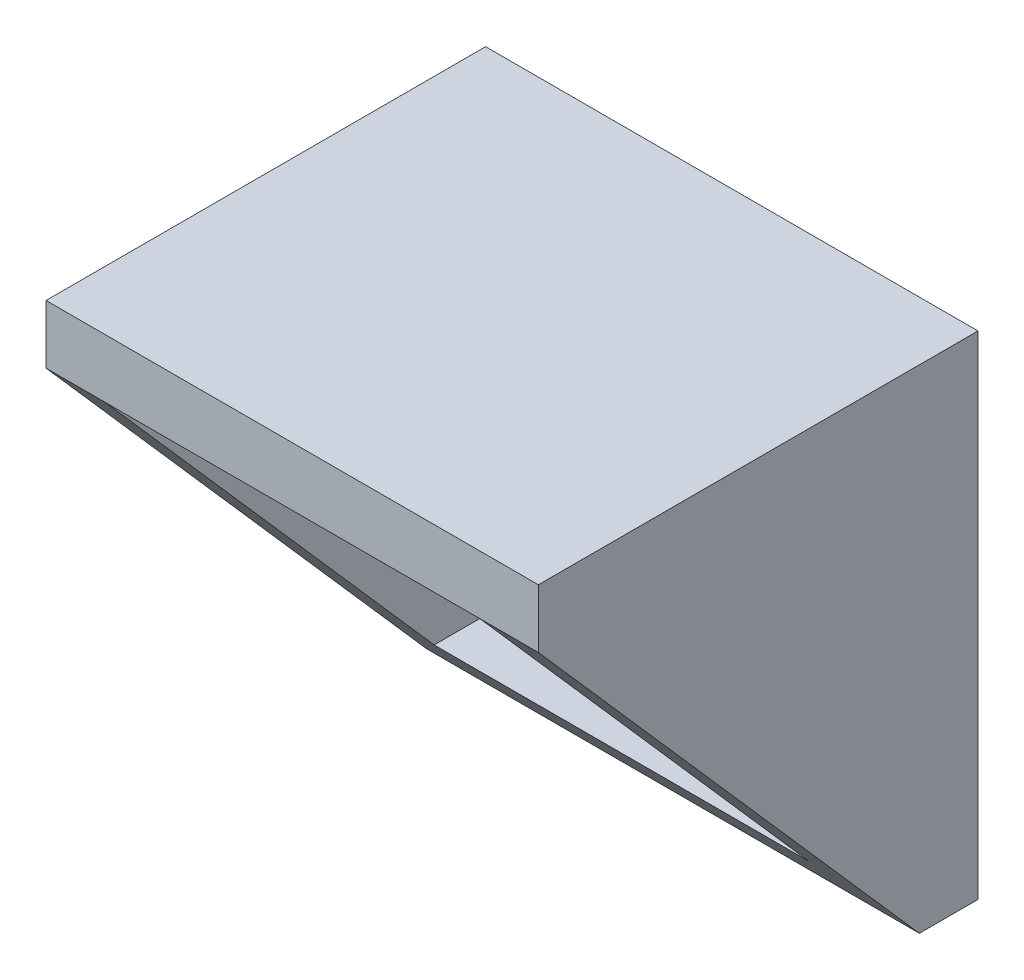
ISO-10303-21;
HEADER;
FILE_DESCRIPTION(('STEP AP214'),'2;1');
FILE_NAME('part.step','',(''),(''),'','','');
FILE_SCHEMA(('AUTOMOTIVE_DESIGN { 1 0 10303 214 1 1 1 1 }'));
ENDSEC;
DATA;
#1=APPLICATION_CONTEXT('core data for automotive mechanical design processes');
#2=APPLICATION_PROTOCOL_DEFINITION('international standard','automotive_design',2000,#1);
#3=PRODUCT_CONTEXT('',#1,'mechanical');
#4=PRODUCT('Part','Part','',(#3));
#5=PRODUCT_RELATED_PRODUCT_CATEGORY('part','',(#4));
#6=PRODUCT_DEFINITION_FORMATION('','',#4);
#7=PRODUCT_DEFINITION_CONTEXT('part definition',#1,'design');
#8=PRODUCT_DEFINITION('design','',#6,#7);
#9=PRODUCT_DEFINITION_SHAPE('','',#8);
#10=(LENGTH_UNIT() NAMED_UNIT(*) SI_UNIT(.MILLI.,.METRE.));
#11=(NAMED_UNIT(*) PLANE_ANGLE_UNIT() SI_UNIT($,.RADIAN.));
#12=(NAMED_UNIT(*) SI_UNIT($,.STERADIAN.) SOLID_ANGLE_UNIT());
#13=UNCERTAINTY_MEASURE_WITH_UNIT(LENGTH_MEASURE(1.E-05),#10,'distance_accuracy_value','');
#14=(GEOMETRIC_REPRESENTATION_CONTEXT(3) GLOBAL_UNCERTAINTY_ASSIGNED_CONTEXT((#13)) GLOBAL_UNIT_ASSIGNED_CONTEXT((#10,
#11,#12)) REPRESENTATION_CONTEXT('',''));
#15=CARTESIAN_POINT('',(0.,0.,0.));
#16=DIRECTION('',(0.,0.,1.));
#17=DIRECTION('',(1.,0.,0.));
#18=AXIS2_PLACEMENT_3D('',#15,#16,#17);
#19=CARTESIAN_POINT('',(0.,0.,15.));
#20=DIRECTION('',(0.,0.,1.));
#21=DIRECTION('',(1.,0.,0.));
#22=AXIS2_PLACEMENT_3D('',#19,#20,#21);
#23=PLANE('',#22);
#24=DIRECTION('',(1.,0.,0.));
#25=VECTOR('',#24,1.);
#26=CARTESIAN_POINT('',(-8.4,6.4,15.));
#27=LINE('',#26,#25);
#28=CARTESIAN_POINT('',(6.4,6.4,15.));
#29=VERTEX_POINT('',#28);
#30=CARTESIAN_POINT('',(8.4,6.4,15.));
#31=VERTEX_POINT('',#30);
#32=EDGE_CURVE('E48',#29,#31,#27,.T.);
#33=ORIENTED_EDGE('',*,*,#32,.T.);
#34=DIRECTION('',(0.,1.,0.));
#35=VECTOR('',#34,1.);
#36=CARTESIAN_POINT('',(8.4,8.4,15.));
#37=LINE('',#36,#35);
#38=CARTESIAN_POINT('',(8.4,8.4,15.));
#39=VERTEX_POINT('',#38);
#40=EDGE_CURVE('E157',#31,#39,#37,.T.);
#41=ORIENTED_EDGE('',*,*,#40,.T.);
#42=DIRECTION('',(-1.,0.,0.));
#43=VECTOR('',#42,1.);
#44=CARTESIAN_POINT('',(-8.4,8.4,15.));
#45=LINE('',#44,#43);
#46=CARTESIAN_POINT('',(-8.4,8.4,15.));
#47=VERTEX_POINT('',#46);
#48=EDGE_CURVE('E137',#39,#47,#45,.T.);
#49=ORIENTED_EDGE('',*,*,#48,.T.);
#50=DIRECTION('',(0.,-1.,0.));
#51=VECTOR('',#50,1.);
#52=CARTESIAN_POINT('',(-8.4,8.4,15.));
#53=LINE('',#52,#51);
#54=CARTESIAN_POINT('',(-8.4,6.4,15.));
#55=VERTEX_POINT('',#54);
#56=EDGE_CURVE('E143',#47,#55,#53,.T.);
#57=ORIENTED_EDGE('',*,*,#56,.T.);
#58=CARTESIAN_POINT('',(-6.4,6.4,15.));
#59=VERTEX_POINT('',#58);
#60=EDGE_CURVE('E108',#55,#59,#27,.T.);
#61=ORIENTED_EDGE('',*,*,#60,.T.);
#62=DIRECTION('',(-1.,0.,0.));
#63=VECTOR('',#62,1.);
#64=CARTESIAN_POINT('',(-6.4,6.4,15.));
#65=LINE('',#64,#63);
#66=EDGE_CURVE('E166',#29,#59,#65,.T.);
#67=ORIENTED_EDGE('',*,*,#66,.F.);
#68=EDGE_LOOP('',(#33,#41,#49,#57,#61,#67));
#69=FACE_BOUND('',#68,.T.);
#70=ADVANCED_FACE('F33',(#69),#23,.T.);
#71=CARTESIAN_POINT('',(0.,0.,0.));
#72=DIRECTION('',(0.,0.,1.));
#73=DIRECTION('',(1.,0.,0.));
#74=AXIS2_PLACEMENT_3D('',#71,#72,#73);
#75=PLANE('',#74);
#76=DIRECTION('',(0.,-1.,0.));
#77=VECTOR('',#76,1.);
#78=CARTESIAN_POINT('',(-8.4,8.4,0.));
#79=LINE('',#78,#77);
#80=CARTESIAN_POINT('',(-8.4,8.4,0.));
#81=VERTEX_POINT('',#80);
#82=CARTESIAN_POINT('',(-8.4,-8.4,0.));
#83=VERTEX_POINT('',#82);
#84=EDGE_CURVE('E124',#81,#83,#79,.T.);
#85=ORIENTED_EDGE('',*,*,#84,.F.);
#86=DIRECTION('',(-1.,0.,0.));
#87=VECTOR('',#86,1.);
#88=CARTESIAN_POINT('',(-8.4,8.4,0.));
#89=LINE('',#88,#87);
#90=CARTESIAN_POINT('',(8.4,8.4,0.));
#91=VERTEX_POINT('',#90);
#92=EDGE_CURVE('E141',#91,#81,#89,.T.);
#93=ORIENTED_EDGE('',*,*,#92,.F.);
#94=DIRECTION('',(0.,1.,0.));
#95=VECTOR('',#94,1.);
#96=CARTESIAN_POINT('',(8.4,8.4,0.));
#97=LINE('',#96,#95);
#98=CARTESIAN_POINT('',(8.40000000000001,-8.4,0.));
#99=VERTEX_POINT('',#98);
#100=EDGE_CURVE('E132',#99,#91,#97,.T.);
#101=ORIENTED_EDGE('',*,*,#100,.F.);
#102=DIRECTION('',(1.,0.,0.));
#103=VECTOR('',#102,1.);
#104=CARTESIAN_POINT('',(-8.4,-8.4,0.));
#105=LINE('',#104,#103);
#106=EDGE_CURVE('E129',#83,#99,#105,.T.);
#107=ORIENTED_EDGE('',*,*,#106,.F.);
#108=EDGE_LOOP('',(#85,#93,#101,#107));
#109=FACE_BOUND('',#108,.T.);
#110=DIRECTION('',(0.,-1.,0.));
#111=VECTOR('',#110,1.);
#112=CARTESIAN_POINT('',(-6.4,6.4,0.));
#113=LINE('',#112,#111);
#114=CARTESIAN_POINT('',(-6.4,6.4,0.));
#115=VERTEX_POINT('',#114);
#116=CARTESIAN_POINT('',(-6.4,-6.4,0.));
#117=VERTEX_POINT('',#116);
#118=EDGE_CURVE('E56',#115,#117,#113,.T.);
#119=ORIENTED_EDGE('',*,*,#118,.T.);
#120=DIRECTION('',(1.,0.,0.));
#121=VECTOR('',#120,1.);
#122=CARTESIAN_POINT('',(-6.4,-6.4,0.));
#123=LINE('',#122,#121);
#124=CARTESIAN_POINT('',(6.4,-6.4,0.));
#125=VERTEX_POINT('',#124);
#126=EDGE_CURVE('E173',#117,#125,#123,.T.);
#127=ORIENTED_EDGE('',*,*,#126,.T.);
#128=DIRECTION('',(0.,1.,0.));
#129=VECTOR('',#128,1.);
#130=CARTESIAN_POINT('',(6.4,6.4,0.));
#131=LINE('',#130,#129);
#132=CARTESIAN_POINT('',(6.4,6.4,0.));
#133=VERTEX_POINT('',#132);
#134=EDGE_CURVE('E170',#125,#133,#131,.T.);
#135=ORIENTED_EDGE('',*,*,#134,.T.);
#136=DIRECTION('',(-1.,0.,0.));
#137=VECTOR('',#136,1.);
#138=CARTESIAN_POINT('',(-6.4,6.4,0.));
#139=LINE('',#138,#137);
#140=EDGE_CURVE('E167',#133,#115,#139,.T.);
#141=ORIENTED_EDGE('',*,*,#140,.T.);
#142=EDGE_LOOP('',(#119,#127,#135,#141));
#143=FACE_BOUND('',#142,.T.);
#144=ADVANCED_FACE('F152',(#109,#143),#75,.F.);
#145=CARTESIAN_POINT('',(-8.4,8.4,15.));
#146=DIRECTION('',(1.,0.,0.));
#147=DIRECTION('',(0.,1.,0.));
#148=AXIS2_PLACEMENT_3D('',#145,#146,#147);
#149=PLANE('',#148);
#150=DIRECTION('',(0.,0.,-1.));
#151=VECTOR('',#150,1.);
#152=CARTESIAN_POINT('',(-8.4,-8.4,15.));
#153=LINE('',#152,#151);
#154=CARTESIAN_POINT('',(-8.4,-8.4,2.));
#155=VERTEX_POINT('',#154);
#156=EDGE_CURVE('E11',#155,#83,#153,.T.);
#157=ORIENTED_EDGE('',*,*,#156,.F.);
#158=DIRECTION('',(0.,0.751317435494103,0.659940990636712));
#159=VECTOR('',#158,1.);
#160=CARTESIAN_POINT('',(-8.4,6.4,15.));
#161=LINE('',#160,#159);
#162=EDGE_CURVE('E102',#155,#55,#161,.T.);
#163=ORIENTED_EDGE('',*,*,#162,.T.);
#164=ORIENTED_EDGE('',*,*,#56,.F.);
#165=DIRECTION('',(0.,0.,-1.));
#166=VECTOR('',#165,1.);
#167=CARTESIAN_POINT('',(-8.4,8.4,15.));
#168=LINE('',#167,#166);
#169=EDGE_CURVE('E126',#47,#81,#168,.T.);
#170=ORIENTED_EDGE('',*,*,#169,.T.);
#171=ORIENTED_EDGE('',*,*,#84,.T.);
#172=EDGE_LOOP('',(#157,#163,#164,#170,#171));
#173=FACE_BOUND('',#172,.T.);
#174=ADVANCED_FACE('F35',(#173),#149,.F.);
#175=CARTESIAN_POINT('',(-8.4,-8.4,15.));
#176=DIRECTION('',(0.,1.,0.));
#177=DIRECTION('',(-1.,0.,0.));
#178=AXIS2_PLACEMENT_3D('',#175,#176,#177);
#179=PLANE('',#178);
#180=DIRECTION('',(0.,0.,-1.));
#181=VECTOR('',#180,1.);
#182=CARTESIAN_POINT('',(8.40000000000001,-8.4,15.));
#183=LINE('',#182,#181);
#184=CARTESIAN_POINT('',(8.40000000000001,-8.4,2.));
#185=VERTEX_POINT('',#184);
#186=EDGE_CURVE('E41',#185,#99,#183,.T.);
#187=ORIENTED_EDGE('',*,*,#186,.F.);
#188=DIRECTION('',(1.,0.,0.));
#189=VECTOR('',#188,1.);
#190=CARTESIAN_POINT('',(-8.4,-8.4,2.));
#191=LINE('',#190,#189);
#192=EDGE_CURVE('E105',#155,#185,#191,.T.);
#193=ORIENTED_EDGE('',*,*,#192,.F.);
#194=ORIENTED_EDGE('',*,*,#156,.T.);
#195=ORIENTED_EDGE('',*,*,#106,.T.);
#196=EDGE_LOOP('',(#187,#193,#194,#195));
#197=FACE_BOUND('',#196,.T.);
#198=ADVANCED_FACE('F117',(#197),#179,.F.);
#199=CARTESIAN_POINT('',(8.4,8.4,15.));
#200=DIRECTION('',(-1.,0.,0.));
#201=DIRECTION('',(0.,-1.,0.));
#202=AXIS2_PLACEMENT_3D('',#199,#200,#201);
#203=PLANE('',#202);
#204=ORIENTED_EDGE('',*,*,#40,.F.);
#205=DIRECTION('',(0.,0.751317435494103,0.659940990636712));
#206=VECTOR('',#205,1.);
#207=CARTESIAN_POINT('',(8.4,6.4,15.));
#208=LINE('',#207,#206);
#209=EDGE_CURVE('E113',#185,#31,#208,.T.);
#210=ORIENTED_EDGE('',*,*,#209,.F.);
#211=ORIENTED_EDGE('',*,*,#186,.T.);
#212=ORIENTED_EDGE('',*,*,#100,.T.);
#213=DIRECTION('',(0.,0.,-1.));
#214=VECTOR('',#213,1.);
#215=CARTESIAN_POINT('',(8.4,8.4,15.));
#216=LINE('',#215,#214);
#217=EDGE_CURVE('E145',#39,#91,#216,.T.);
#218=ORIENTED_EDGE('',*,*,#217,.F.);
#219=EDGE_LOOP('',(#204,#210,#211,#212,#218));
#220=FACE_BOUND('',#219,.T.);
#221=ADVANCED_FACE('F149',(#220),#203,.F.);
#222=CARTESIAN_POINT('',(-8.4,8.4,15.));
#223=DIRECTION('',(0.,-1.,0.));
#224=DIRECTION('',(1.,0.,0.));
#225=AXIS2_PLACEMENT_3D('',#222,#223,#224);
#226=PLANE('',#225);
#227=ORIENTED_EDGE('',*,*,#92,.T.);
#228=ORIENTED_EDGE('',*,*,#169,.F.);
#229=ORIENTED_EDGE('',*,*,#48,.F.);
#230=ORIENTED_EDGE('',*,*,#217,.T.);
#231=EDGE_LOOP('',(#227,#228,#229,#230));
#232=FACE_BOUND('',#231,.T.);
#233=ADVANCED_FACE('F155',(#232),#226,.F.);
#234=CARTESIAN_POINT('',(-6.4,6.4,15.));
#235=DIRECTION('',(1.,0.,0.));
#236=DIRECTION('',(0.,1.,0.));
#237=AXIS2_PLACEMENT_3D('',#234,#235,#236);
#238=PLANE('',#237);
#239=DIRECTION('',(0.,0.751317435494103,0.659940990636712));
#240=VECTOR('',#239,1.);
#241=CARTESIAN_POINT('',(-6.4,6.4,15.));
#242=LINE('',#241,#240);
#243=CARTESIAN_POINT('',(-6.4,-6.4,3.75675675675676));
#244=VERTEX_POINT('',#243);
#245=EDGE_CURVE('E177',#244,#59,#242,.T.);
#246=ORIENTED_EDGE('',*,*,#245,.F.);
#247=DIRECTION('',(0.,0.,-1.));
#248=VECTOR('',#247,1.);
#249=CARTESIAN_POINT('',(-6.4,-6.4,15.));
#250=LINE('',#249,#248);
#251=EDGE_CURVE('E130',#244,#117,#250,.T.);
#252=ORIENTED_EDGE('',*,*,#251,.T.);
#253=ORIENTED_EDGE('',*,*,#118,.F.);
#254=DIRECTION('',(0.,0.,-1.));
#255=VECTOR('',#254,1.);
#256=CARTESIAN_POINT('',(-6.4,6.4,15.));
#257=LINE('',#256,#255);
#258=EDGE_CURVE('E164',#59,#115,#257,.T.);
#259=ORIENTED_EDGE('',*,*,#258,.F.);
#260=EDGE_LOOP('',(#246,#252,#253,#259));
#261=FACE_BOUND('',#260,.T.);
#262=ADVANCED_FACE('F192',(#261),#238,.T.);
#263=CARTESIAN_POINT('',(-6.4,-6.4,15.));
#264=DIRECTION('',(0.,1.,0.));
#265=DIRECTION('',(-1.,0.,0.));
#266=AXIS2_PLACEMENT_3D('',#263,#264,#265);
#267=PLANE('',#266);
#268=DIRECTION('',(-1.,0.,0.));
#269=VECTOR('',#268,1.);
#270=CARTESIAN_POINT('',(-6.4,-6.4,3.75675675675676));
#271=LINE('',#270,#269);
#272=CARTESIAN_POINT('',(6.4,-6.4,3.75675675675676));
#273=VERTEX_POINT('',#272);
#274=EDGE_CURVE('E181',#273,#244,#271,.T.);
#275=ORIENTED_EDGE('',*,*,#274,.F.);
#276=DIRECTION('',(0.,0.,-1.));
#277=VECTOR('',#276,1.);
#278=CARTESIAN_POINT('',(6.4,-6.4,15.));
#279=LINE('',#278,#277);
#280=EDGE_CURVE('E134',#273,#125,#279,.T.);
#281=ORIENTED_EDGE('',*,*,#280,.T.);
#282=ORIENTED_EDGE('',*,*,#126,.F.);
#283=ORIENTED_EDGE('',*,*,#251,.F.);
#284=EDGE_LOOP('',(#275,#281,#282,#283));
#285=FACE_BOUND('',#284,.T.);
#286=ADVANCED_FACE('F197',(#285),#267,.T.);
#287=CARTESIAN_POINT('',(6.4,6.4,15.));
#288=DIRECTION('',(-1.,0.,0.));
#289=DIRECTION('',(0.,-1.,0.));
#290=AXIS2_PLACEMENT_3D('',#287,#288,#289);
#291=PLANE('',#290);
#292=DIRECTION('',(0.,-0.751317435494103,-0.659940990636712));
#293=VECTOR('',#292,1.);
#294=CARTESIAN_POINT('',(6.4,6.4,15.));
#295=LINE('',#294,#293);
#296=EDGE_CURVE('E183',#29,#273,#295,.T.);
#297=ORIENTED_EDGE('',*,*,#296,.F.);
#298=DIRECTION('',(0.,0.,-1.));
#299=VECTOR('',#298,1.);
#300=CARTESIAN_POINT('',(6.4,6.4,15.));
#301=LINE('',#300,#299);
#302=EDGE_CURVE('E162',#29,#133,#301,.T.);
#303=ORIENTED_EDGE('',*,*,#302,.T.);
#304=ORIENTED_EDGE('',*,*,#134,.F.);
#305=ORIENTED_EDGE('',*,*,#280,.F.);
#306=EDGE_LOOP('',(#297,#303,#304,#305));
#307=FACE_BOUND('',#306,.T.);
#308=ADVANCED_FACE('F201',(#307),#291,.T.);
#309=CARTESIAN_POINT('',(-6.4,6.4,15.));
#310=DIRECTION('',(0.,-1.,0.));
#311=DIRECTION('',(1.,0.,0.));
#312=AXIS2_PLACEMENT_3D('',#309,#310,#311);
#313=PLANE('',#312);
#314=ORIENTED_EDGE('',*,*,#140,.F.);
#315=ORIENTED_EDGE('',*,*,#302,.F.);
#316=ORIENTED_EDGE('',*,*,#66,.T.);
#317=ORIENTED_EDGE('',*,*,#258,.T.);
#318=EDGE_LOOP('',(#314,#315,#316,#317));
#319=FACE_BOUND('',#318,.T.);
#320=ADVANCED_FACE('F190',(#319),#313,.T.);
#321=CARTESIAN_POINT('',(-8.4,6.4,15.));
#322=DIRECTION('',(0.,0.659940990636712,-0.751317435494103));
#323=DIRECTION('',(0.,0.751317435494103,0.659940990636712));
#324=AXIS2_PLACEMENT_3D('',#321,#322,#323);
#325=PLANE('',#324);
#326=ORIENTED_EDGE('',*,*,#245,.T.);
#327=ORIENTED_EDGE('',*,*,#60,.F.);
#328=ORIENTED_EDGE('',*,*,#162,.F.);
#329=ORIENTED_EDGE('',*,*,#192,.T.);
#330=ORIENTED_EDGE('',*,*,#209,.T.);
#331=ORIENTED_EDGE('',*,*,#32,.F.);
#332=ORIENTED_EDGE('',*,*,#296,.T.);
#333=ORIENTED_EDGE('',*,*,#274,.T.);
#334=EDGE_LOOP('',(#326,#327,#328,#329,#330,#331,#332,#333));
#335=FACE_BOUND('',#334,.T.);
#336=ADVANCED_FACE('F104',(#335),#325,.F.);
#337=CLOSED_SHELL('',(#70,#144,#174,#198,#221,#233,#262,#286,#308,#320,#336));
#338=MANIFOLD_SOLID_BREP('B2',#337);
#339=ADVANCED_BREP_SHAPE_REPRESENTATION('',(#18,#338),#14);
#340=SHAPE_DEFINITION_REPRESENTATION(#9,#339);
ENDSEC;
END-ISO-10303-21;
